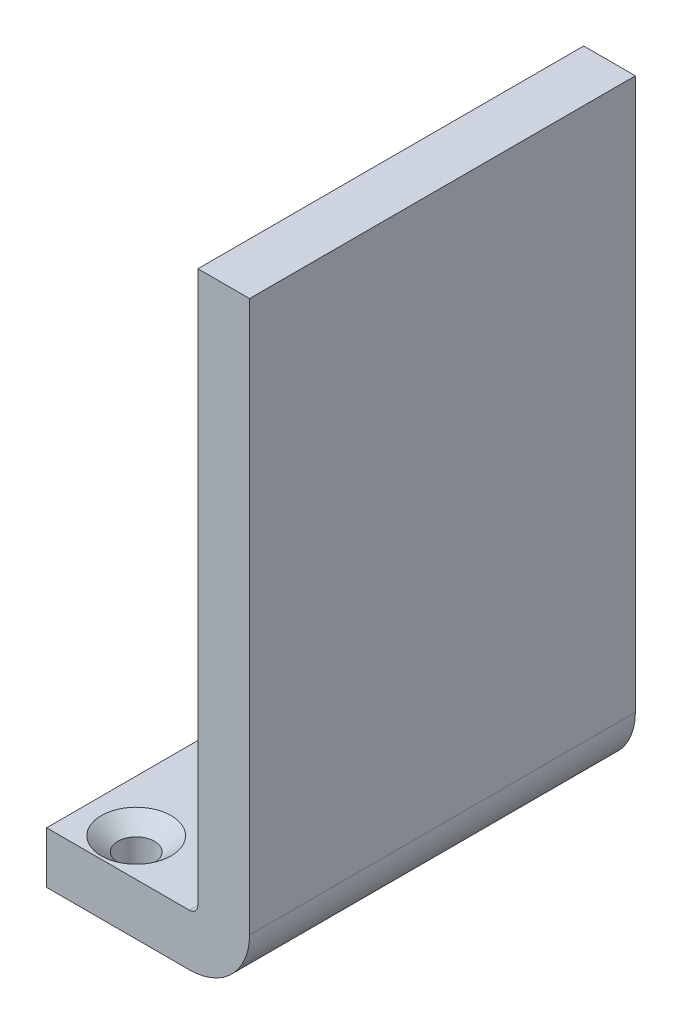
ISO-10303-21;
HEADER;
FILE_DESCRIPTION(('STEP AP214'),'2;1');
FILE_NAME('part.step','',(''),(''),'','','');
FILE_SCHEMA(('AUTOMOTIVE_DESIGN { 1 0 10303 214 1 1 1 1 }'));
ENDSEC;
DATA;
#1=APPLICATION_CONTEXT('core data for automotive mechanical design processes');
#2=APPLICATION_PROTOCOL_DEFINITION('international standard','automotive_design',2000,#1);
#3=PRODUCT_CONTEXT('',#1,'mechanical');
#4=PRODUCT('Part','Part','',(#3));
#5=PRODUCT_RELATED_PRODUCT_CATEGORY('part','',(#4));
#6=PRODUCT_DEFINITION_FORMATION('','',#4);
#7=PRODUCT_DEFINITION_CONTEXT('part definition',#1,'design');
#8=PRODUCT_DEFINITION('design','',#6,#7);
#9=PRODUCT_DEFINITION_SHAPE('','',#8);
#10=(LENGTH_UNIT() NAMED_UNIT(*) SI_UNIT(.MILLI.,.METRE.));
#11=(NAMED_UNIT(*) PLANE_ANGLE_UNIT() SI_UNIT($,.RADIAN.));
#12=(NAMED_UNIT(*) SI_UNIT($,.STERADIAN.) SOLID_ANGLE_UNIT());
#13=UNCERTAINTY_MEASURE_WITH_UNIT(LENGTH_MEASURE(1.E-05),#10,'distance_accuracy_value','');
#14=(GEOMETRIC_REPRESENTATION_CONTEXT(3) GLOBAL_UNCERTAINTY_ASSIGNED_CONTEXT((#13)) GLOBAL_UNIT_ASSIGNED_CONTEXT((#10,
#11,#12)) REPRESENTATION_CONTEXT('',''));
#15=CARTESIAN_POINT('',(0.,0.,0.));
#16=DIRECTION('',(0.,0.,1.));
#17=DIRECTION('',(1.,0.,0.));
#18=AXIS2_PLACEMENT_3D('',#15,#16,#17);
#19=CARTESIAN_POINT('',(0.,9.525,-2.54));
#20=DIRECTION('',(1.,0.,0.));
#21=DIRECTION('',(0.,0.,-1.));
#22=AXIS2_PLACEMENT_3D('',#19,#20,#21);
#23=PLANE('',#22);
#24=DIRECTION('',(0.,0.,1.));
#25=VECTOR('',#24,1.);
#26=CARTESIAN_POINT('',(0.,0.,-2.54));
#27=LINE('',#26,#25);
#28=CARTESIAN_POINT('',(0.,0.,-73.66));
#29=VERTEX_POINT('',#28);
#30=CARTESIAN_POINT('',(0.,0.,-2.54));
#31=VERTEX_POINT('',#30);
#32=EDGE_CURVE('E92',#29,#31,#27,.T.);
#33=ORIENTED_EDGE('',*,*,#32,.T.);
#34=DIRECTION('',(0.,-1.,0.));
#35=VECTOR('',#34,1.);
#36=CARTESIAN_POINT('',(0.,9.525,-2.54));
#37=LINE('',#36,#35);
#38=CARTESIAN_POINT('',(0.,9.525,-2.54));
#39=VERTEX_POINT('',#38);
#40=EDGE_CURVE('E45',#39,#31,#37,.T.);
#41=ORIENTED_EDGE('',*,*,#40,.F.);
#42=DIRECTION('',(0.,0.,1.));
#43=VECTOR('',#42,1.);
#44=CARTESIAN_POINT('',(0.,9.525,-2.54));
#45=LINE('',#44,#43);
#46=CARTESIAN_POINT('',(0.,9.525,-73.66));
#47=VERTEX_POINT('',#46);
#48=EDGE_CURVE('E86',#47,#39,#45,.T.);
#49=ORIENTED_EDGE('',*,*,#48,.F.);
#50=DIRECTION('',(0.,-1.,0.));
#51=VECTOR('',#50,1.);
#52=CARTESIAN_POINT('',(0.,9.525,-73.66));
#53=LINE('',#52,#51);
#54=EDGE_CURVE('E76',#47,#29,#53,.T.);
#55=ORIENTED_EDGE('',*,*,#54,.T.);
#56=EDGE_LOOP('',(#33,#41,#49,#55));
#57=FACE_BOUND('',#56,.T.);
#58=ADVANCED_FACE('F33',(#57),#23,.F.);
#59=CARTESIAN_POINT('',(0.,9.525,-2.54));
#60=DIRECTION('',(0.,0.,-1.));
#61=DIRECTION('',(-1.,0.,0.));
#62=AXIS2_PLACEMENT_3D('',#59,#60,#61);
#63=PLANE('',#62);
#64=DIRECTION('',(1.,0.,0.));
#65=VECTOR('',#64,1.);
#66=CARTESIAN_POINT('',(0.,0.,-2.54));
#67=LINE('',#66,#65);
#68=CARTESIAN_POINT('',(26.2934153459015,0.,-2.54));
#69=VERTEX_POINT('',#68);
#70=EDGE_CURVE('E87',#31,#69,#67,.T.);
#71=ORIENTED_EDGE('',*,*,#70,.T.);
#72=CARTESIAN_POINT('',(26.2934153459015,11.1125,-2.54));
#73=DIRECTION('',(0.,0.,1.));
#74=DIRECTION('',(1.,0.,0.));
#75=AXIS2_PLACEMENT_3D('',#72,#73,#74);
#76=CIRCLE('',#75,11.1125);
#77=CARTESIAN_POINT('',(37.4059153459015,11.1125,-2.54));
#78=VERTEX_POINT('',#77);
#79=EDGE_CURVE('E175',#69,#78,#76,.T.);
#80=ORIENTED_EDGE('',*,*,#79,.T.);
#81=DIRECTION('',(0.,1.,0.));
#82=VECTOR('',#81,1.);
#83=CARTESIAN_POINT('',(37.4059153459015,11.1125,-2.54));
#84=LINE('',#83,#82);
#85=CARTESIAN_POINT('',(37.4059153459015,112.7125,-2.54));
#86=VERTEX_POINT('',#85);
#87=EDGE_CURVE('E151',#78,#86,#84,.T.);
#88=ORIENTED_EDGE('',*,*,#87,.T.);
#89=DIRECTION('',(1.,0.,0.));
#90=VECTOR('',#89,1.);
#91=CARTESIAN_POINT('',(27.8809153459015,112.7125,-2.54));
#92=LINE('',#91,#90);
#93=CARTESIAN_POINT('',(27.8809153459015,112.7125,-2.54));
#94=VERTEX_POINT('',#93);
#95=EDGE_CURVE('E172',#94,#86,#92,.T.);
#96=ORIENTED_EDGE('',*,*,#95,.F.);
#97=DIRECTION('',(0.,1.,0.));
#98=VECTOR('',#97,1.);
#99=CARTESIAN_POINT('',(27.8809153459015,11.1125,-2.54));
#100=LINE('',#99,#98);
#101=CARTESIAN_POINT('',(27.8809153459015,11.1125,-2.54));
#102=VERTEX_POINT('',#101);
#103=EDGE_CURVE('E160',#102,#94,#100,.T.);
#104=ORIENTED_EDGE('',*,*,#103,.F.);
#105=CARTESIAN_POINT('',(26.2934153459015,11.1125,-2.54));
#106=DIRECTION('',(0.,0.,1.));
#107=DIRECTION('',(1.,0.,0.));
#108=AXIS2_PLACEMENT_3D('',#105,#106,#107);
#109=CIRCLE('',#108,1.5875);
#110=CARTESIAN_POINT('',(26.2934153459015,9.525,-2.54));
#111=VERTEX_POINT('',#110);
#112=EDGE_CURVE('E116',#111,#102,#109,.T.);
#113=ORIENTED_EDGE('',*,*,#112,.F.);
#114=DIRECTION('',(1.,0.,0.));
#115=VECTOR('',#114,1.);
#116=CARTESIAN_POINT('',(0.,9.525,-2.54));
#117=LINE('',#116,#115);
#118=EDGE_CURVE('E112',#39,#111,#117,.T.);
#119=ORIENTED_EDGE('',*,*,#118,.F.);
#120=ORIENTED_EDGE('',*,*,#40,.T.);
#121=EDGE_LOOP('',(#71,#80,#88,#96,#104,#113,#119,#120));
#122=FACE_BOUND('',#121,.T.);
#123=ADVANCED_FACE('F106',(#122),#63,.F.);
#124=CARTESIAN_POINT('',(0.,9.525,-73.66));
#125=DIRECTION('',(0.,0.,1.));
#126=DIRECTION('',(1.,0.,0.));
#127=AXIS2_PLACEMENT_3D('',#124,#125,#126);
#128=PLANE('',#127);
#129=DIRECTION('',(-1.,0.,0.));
#130=VECTOR('',#129,1.);
#131=CARTESIAN_POINT('',(0.,0.,-73.66));
#132=LINE('',#131,#130);
#133=CARTESIAN_POINT('',(26.2934153459015,0.,-73.66));
#134=VERTEX_POINT('',#133);
#135=EDGE_CURVE('E73',#134,#29,#132,.T.);
#136=ORIENTED_EDGE('',*,*,#135,.T.);
#137=ORIENTED_EDGE('',*,*,#54,.F.);
#138=DIRECTION('',(-1.,0.,0.));
#139=VECTOR('',#138,1.);
#140=CARTESIAN_POINT('',(0.,9.525,-73.66));
#141=LINE('',#140,#139);
#142=CARTESIAN_POINT('',(26.2934153459015,9.525,-73.66));
#143=VERTEX_POINT('',#142);
#144=EDGE_CURVE('E59',#143,#47,#141,.T.);
#145=ORIENTED_EDGE('',*,*,#144,.F.);
#146=CARTESIAN_POINT('',(26.2934153459015,11.1125,-73.66));
#147=DIRECTION('',(0.,0.,1.));
#148=DIRECTION('',(1.,0.,0.));
#149=AXIS2_PLACEMENT_3D('',#146,#147,#148);
#150=CIRCLE('',#149,1.5875);
#151=CARTESIAN_POINT('',(27.8809153459015,11.1125,-73.66));
#152=VERTEX_POINT('',#151);
#153=EDGE_CURVE('E178',#143,#152,#150,.T.);
#154=ORIENTED_EDGE('',*,*,#153,.T.);
#155=DIRECTION('',(0.,1.,0.));
#156=VECTOR('',#155,1.);
#157=CARTESIAN_POINT('',(27.8809153459015,11.1125,-73.66));
#158=LINE('',#157,#156);
#159=CARTESIAN_POINT('',(27.8809153459015,112.7125,-73.66));
#160=VERTEX_POINT('',#159);
#161=EDGE_CURVE('E157',#152,#160,#158,.T.);
#162=ORIENTED_EDGE('',*,*,#161,.T.);
#163=DIRECTION('',(-1.,0.,0.));
#164=VECTOR('',#163,1.);
#165=CARTESIAN_POINT('',(27.8809153459015,112.7125,-73.66));
#166=LINE('',#165,#164);
#167=CARTESIAN_POINT('',(37.4059153459015,112.7125,-73.66));
#168=VERTEX_POINT('',#167);
#169=EDGE_CURVE('E166',#168,#160,#166,.T.);
#170=ORIENTED_EDGE('',*,*,#169,.F.);
#171=DIRECTION('',(0.,1.,0.));
#172=VECTOR('',#171,1.);
#173=CARTESIAN_POINT('',(37.4059153459015,11.1125,-73.66));
#174=LINE('',#173,#172);
#175=CARTESIAN_POINT('',(37.4059153459015,11.1125,-73.66));
#176=VERTEX_POINT('',#175);
#177=EDGE_CURVE('E154',#176,#168,#174,.T.);
#178=ORIENTED_EDGE('',*,*,#177,.F.);
#179=CARTESIAN_POINT('',(26.2934153459015,11.1125,-73.66));
#180=DIRECTION('',(0.,0.,1.));
#181=DIRECTION('',(1.,0.,0.));
#182=AXIS2_PLACEMENT_3D('',#179,#180,#181);
#183=CIRCLE('',#182,11.1125);
#184=EDGE_CURVE('E81',#134,#176,#183,.T.);
#185=ORIENTED_EDGE('',*,*,#184,.F.);
#186=EDGE_LOOP('',(#136,#137,#145,#154,#162,#170,#178,#185));
#187=FACE_BOUND('',#186,.T.);
#188=ADVANCED_FACE('F75',(#187),#128,.F.);
#189=CARTESIAN_POINT('',(0.,9.525,0.));
#190=DIRECTION('',(0.,-1.,0.));
#191=DIRECTION('',(0.,0.,-1.));
#192=AXIS2_PLACEMENT_3D('',#189,#190,#191);
#193=PLANE('',#192);
#194=CARTESIAN_POINT('',(9.525,9.525,-9.525));
#195=DIRECTION('',(0.,1.,0.));
#196=DIRECTION('',(0.,0.,1.));
#197=AXIS2_PLACEMENT_3D('',#194,#195,#196);
#198=CIRCLE('',#197,6.4389);
#199=CARTESIAN_POINT('',(9.525,9.525,-3.0861));
#200=VERTEX_POINT('',#199);
#201=EDGE_CURVE('E148',#200,#200,#198,.T.);
#202=ORIENTED_EDGE('',*,*,#201,.F.);
#203=EDGE_LOOP('',(#202));
#204=FACE_BOUND('',#203,.T.);
#205=CARTESIAN_POINT('',(9.52499999999999,9.525,-45.4406));
#206=DIRECTION('',(0.,1.,0.));
#207=DIRECTION('',(0.,0.,1.));
#208=AXIS2_PLACEMENT_3D('',#205,#206,#207);
#209=CIRCLE('',#208,6.4389);
#210=CARTESIAN_POINT('',(13.2418497911538,9.525,-40.1828));
#211=VERTEX_POINT('',#210);
#212=CARTESIAN_POINT('',(5.8081502088462,9.525,-40.1828));
#213=VERTEX_POINT('',#212);
#214=EDGE_CURVE('E132',#211,#213,#209,.T.);
#215=ORIENTED_EDGE('',*,*,#214,.F.);
#216=CARTESIAN_POINT('',(9.525,9.525,-34.925));
#217=DIRECTION('',(0.,1.,0.));
#218=DIRECTION('',(0.,0.,1.));
#219=AXIS2_PLACEMENT_3D('',#216,#217,#218);
#220=CIRCLE('',#219,6.4389);
#221=EDGE_CURVE('E51',#213,#211,#220,.T.);
#222=ORIENTED_EDGE('',*,*,#221,.F.);
#223=EDGE_LOOP('',(#215,#222));
#224=FACE_BOUND('',#223,.T.);
#225=CARTESIAN_POINT('',(9.52499999999999,9.525,-66.3194));
#226=DIRECTION('',(0.,1.,0.));
#227=DIRECTION('',(0.,0.,1.));
#228=AXIS2_PLACEMENT_3D('',#225,#226,#227);
#229=CIRCLE('',#228,6.4389);
#230=CARTESIAN_POINT('',(9.52499999999999,9.525,-59.8805));
#231=VERTEX_POINT('',#230);
#232=EDGE_CURVE('E123',#231,#231,#229,.T.);
#233=ORIENTED_EDGE('',*,*,#232,.F.);
#234=EDGE_LOOP('',(#233));
#235=FACE_BOUND('',#234,.T.);
#236=ORIENTED_EDGE('',*,*,#48,.T.);
#237=ORIENTED_EDGE('',*,*,#118,.T.);
#238=DIRECTION('',(0.,0.,1.));
#239=VECTOR('',#238,1.);
#240=CARTESIAN_POINT('',(26.2934153459015,9.525,-2.54));
#241=LINE('',#240,#239);
#242=EDGE_CURVE('E188',#143,#111,#241,.T.);
#243=ORIENTED_EDGE('',*,*,#242,.F.);
#244=ORIENTED_EDGE('',*,*,#144,.T.);
#245=EDGE_LOOP('',(#236,#237,#243,#244));
#246=FACE_BOUND('',#245,.T.);
#247=ADVANCED_FACE('F118',(#204,#224,#235,#246),#193,.F.);
#248=CARTESIAN_POINT('',(0.,0.,0.));
#249=DIRECTION('',(0.,-1.,0.));
#250=DIRECTION('',(0.,0.,-1.));
#251=AXIS2_PLACEMENT_3D('',#248,#249,#250);
#252=PLANE('',#251);
#253=CARTESIAN_POINT('',(9.525,0.,-9.525));
#254=DIRECTION('',(0.,1.,0.));
#255=DIRECTION('',(0.,0.,1.));
#256=AXIS2_PLACEMENT_3D('',#253,#254,#255);
#257=CIRCLE('',#256,3.3782);
#258=CARTESIAN_POINT('',(9.525,0.,-6.1468));
#259=VERTEX_POINT('',#258);
#260=EDGE_CURVE('E142',#259,#259,#257,.T.);
#261=ORIENTED_EDGE('',*,*,#260,.T.);
#262=EDGE_LOOP('',(#261));
#263=FACE_BOUND('',#262,.T.);
#264=CARTESIAN_POINT('',(9.525,0.,-34.925));
#265=DIRECTION('',(0.,1.,0.));
#266=DIRECTION('',(0.,0.,1.));
#267=AXIS2_PLACEMENT_3D('',#264,#265,#266);
#268=CIRCLE('',#267,3.3782);
#269=CARTESIAN_POINT('',(9.525,0.,-31.5468));
#270=VERTEX_POINT('',#269);
#271=EDGE_CURVE('E135',#270,#270,#268,.T.);
#272=ORIENTED_EDGE('',*,*,#271,.T.);
#273=EDGE_LOOP('',(#272));
#274=FACE_BOUND('',#273,.T.);
#275=CARTESIAN_POINT('',(9.52499999999999,0.,-45.4406));
#276=DIRECTION('',(0.,1.,0.));
#277=DIRECTION('',(0.,0.,1.));
#278=AXIS2_PLACEMENT_3D('',#275,#276,#277);
#279=CIRCLE('',#278,3.3782);
#280=CARTESIAN_POINT('',(9.52499999999999,0.,-42.0624));
#281=VERTEX_POINT('',#280);
#282=EDGE_CURVE('E126',#281,#281,#279,.T.);
#283=ORIENTED_EDGE('',*,*,#282,.T.);
#284=EDGE_LOOP('',(#283));
#285=FACE_BOUND('',#284,.T.);
#286=CARTESIAN_POINT('',(9.52499999999999,0.,-66.3194));
#287=DIRECTION('',(0.,1.,0.));
#288=DIRECTION('',(0.,0.,1.));
#289=AXIS2_PLACEMENT_3D('',#286,#287,#288);
#290=CIRCLE('',#289,3.3782);
#291=CARTESIAN_POINT('',(9.52499999999999,0.,-62.9412));
#292=VERTEX_POINT('',#291);
#293=EDGE_CURVE('E97',#292,#292,#290,.T.);
#294=ORIENTED_EDGE('',*,*,#293,.T.);
#295=EDGE_LOOP('',(#294));
#296=FACE_BOUND('',#295,.T.);
#297=ORIENTED_EDGE('',*,*,#32,.F.);
#298=ORIENTED_EDGE('',*,*,#135,.F.);
#299=DIRECTION('',(0.,0.,-1.));
#300=VECTOR('',#299,1.);
#301=CARTESIAN_POINT('',(26.2934153459015,0.,-2.54));
#302=LINE('',#301,#300);
#303=EDGE_CURVE('E190',#69,#134,#302,.T.);
#304=ORIENTED_EDGE('',*,*,#303,.F.);
#305=ORIENTED_EDGE('',*,*,#70,.F.);
#306=EDGE_LOOP('',(#297,#298,#304,#305));
#307=FACE_BOUND('',#306,.T.);
#308=ADVANCED_FACE('F94',(#263,#274,#285,#296,#307),#252,.T.);
#309=CARTESIAN_POINT('',(9.52499999999999,9.525,-66.3194));
#310=DIRECTION('',(0.,1.,0.));
#311=DIRECTION('',(0.,0.,1.));
#312=AXIS2_PLACEMENT_3D('',#309,#310,#311);
#313=CYLINDRICAL_SURFACE('',#312,3.3782);
#314=ORIENTED_EDGE('',*,*,#293,.F.);
#315=EDGE_LOOP('',(#314));
#316=FACE_BOUND('',#315,.T.);
#317=CARTESIAN_POINT('',(9.52499999999999,6.9567677588557,-66.3194));
#318=DIRECTION('',(0.,1.,0.));
#319=DIRECTION('',(0.,0.,1.));
#320=AXIS2_PLACEMENT_3D('',#317,#318,#319);
#321=CIRCLE('',#320,3.3782);
#322=CARTESIAN_POINT('',(9.52499999999999,6.9567677588557,-62.9412));
#323=VERTEX_POINT('',#322);
#324=EDGE_CURVE('E101',#323,#323,#321,.T.);
#325=ORIENTED_EDGE('',*,*,#324,.T.);
#326=EDGE_LOOP('',(#325));
#327=FACE_BOUND('',#326,.T.);
#328=ADVANCED_FACE('F253',(#316,#327),#313,.F.);
#329=CARTESIAN_POINT('',(9.52499999999999,9.525,-66.3194));
#330=DIRECTION('',(0.,1.,0.));
#331=DIRECTION('',(0.,0.,1.));
#332=AXIS2_PLACEMENT_3D('',#329,#330,#331);
#333=CONICAL_SURFACE('',#332,6.4389,0.872664625997166);
#334=ORIENTED_EDGE('',*,*,#324,.F.);
#335=EDGE_LOOP('',(#334));
#336=FACE_BOUND('',#335,.T.);
#337=ORIENTED_EDGE('',*,*,#232,.T.);
#338=EDGE_LOOP('',(#337));
#339=FACE_BOUND('',#338,.T.);
#340=ADVANCED_FACE('F236',(#336,#339),#333,.F.);
#341=CARTESIAN_POINT('',(9.52499999999999,9.525,-45.4406));
#342=DIRECTION('',(0.,1.,0.));
#343=DIRECTION('',(0.,0.,1.));
#344=AXIS2_PLACEMENT_3D('',#341,#342,#343);
#345=CYLINDRICAL_SURFACE('',#344,3.3782);
#346=ORIENTED_EDGE('',*,*,#282,.F.);
#347=EDGE_LOOP('',(#346));
#348=FACE_BOUND('',#347,.T.);
#349=CARTESIAN_POINT('',(9.52499999999999,6.9567677588557,-45.4406));
#350=DIRECTION('',(0.,1.,0.));
#351=DIRECTION('',(0.,0.,1.));
#352=AXIS2_PLACEMENT_3D('',#349,#350,#351);
#353=CIRCLE('',#352,3.3782);
#354=CARTESIAN_POINT('',(9.52499999999999,6.9567677588557,-42.0624));
#355=VERTEX_POINT('',#354);
#356=EDGE_CURVE('E129',#355,#355,#353,.T.);
#357=ORIENTED_EDGE('',*,*,#356,.T.);
#358=EDGE_LOOP('',(#357));
#359=FACE_BOUND('',#358,.T.);
#360=ADVANCED_FACE('F228',(#348,#359),#345,.F.);
#361=CARTESIAN_POINT('',(9.52499999999999,9.525,-45.4406));
#362=DIRECTION('',(0.,1.,0.));
#363=DIRECTION('',(0.,0.,1.));
#364=AXIS2_PLACEMENT_3D('',#361,#362,#363);
#365=CONICAL_SURFACE('',#364,6.4389,0.872664625997165);
#366=ORIENTED_EDGE('',*,*,#356,.F.);
#367=EDGE_LOOP('',(#366));
#368=FACE_BOUND('',#367,.T.);
#369=ORIENTED_EDGE('',*,*,#214,.T.);
#370=CARTESIAN_POINT('',(5.80773731629119,9.5252,-40.1828));
#371=CARTESIAN_POINT('',(5.91825555733399,9.47167170772379,-40.1828));
#372=CARTESIAN_POINT('',(6.02939145108273,9.4194208187292,-40.1828));
#373=CARTESIAN_POINT('',(6.25303839628447,9.31785758896267,-40.1828));
#374=CARTESIAN_POINT('',(6.36554987165421,9.2685461830473,-40.1828));
#375=CARTESIAN_POINT('',(6.70621742130214,9.12524089860833,-40.1828));
#376=CARTESIAN_POINT('',(6.93656601273653,9.03633936822955,-40.1828));
#377=CARTESIAN_POINT('',(7.4016049988188,8.87683546674913,-40.1828));
#378=CARTESIAN_POINT('',(7.63624778575361,8.80609635299186,-40.1828));
#379=CARTESIAN_POINT('',(8.11076892938057,8.68681891595934,-40.1828));
#380=CARTESIAN_POINT('',(8.35063562985329,8.63823560040428,-40.1828));
#381=CARTESIAN_POINT('',(8.782500347839,8.57494345177309,-40.1828));
#382=CARTESIAN_POINT('',(8.97375979398913,8.55521098985455,-40.1828));
#383=CARTESIAN_POINT('',(9.35733528421093,8.53326400105839,-40.1828));
#384=CARTESIAN_POINT('',(9.54965145755658,8.53105166749087,-40.1828));
#385=CARTESIAN_POINT('',(9.93374990151626,8.54431828455256,-40.1828));
#386=CARTESIAN_POINT('',(10.1255318741165,8.55980566418323,-40.1828));
#387=CARTESIAN_POINT('',(10.5069727075907,8.60743079407081,-40.1828));
#388=CARTESIAN_POINT('',(10.696631583647,8.63956842518453,-40.1828));
#389=CARTESIAN_POINT('',(11.0894052016253,8.72208078427035,-40.1828));
#390=CARTESIAN_POINT('',(11.2922306037224,8.77381448596506,-40.1828));
#391=CARTESIAN_POINT('',(11.6936652821695,8.89188137928578,-40.1828));
#392=CARTESIAN_POINT('',(11.892271459638,8.9582249207509,-40.1828));
#393=CARTESIAN_POINT('',(12.285341135383,9.10277544415048,-40.1828));
#394=CARTESIAN_POINT('',(12.4797994549578,9.18099636759885,-40.1828));
#395=CARTESIAN_POINT('',(12.7682005162649,9.30528783674452,-40.1828));
#396=CARTESIAN_POINT('',(12.8636896400967,9.3478308736082,-40.1828));
#397=CARTESIAN_POINT('',(13.0536895133975,9.43500686680251,-40.1828));
#398=CARTESIAN_POINT('',(13.1482004339717,9.47963944982396,-40.1828));
#399=CARTESIAN_POINT('',(13.2422626837094,9.52520000000029,-40.1828));
#400=B_SPLINE_CURVE_WITH_KNOTS('',3,(#370,#371,#372,#373,#374,#375,#376,#377,#378,#379,#380,
#381,#382,#383,#384,#385,#386,#387,#388,#389,#390,#391,#392,#393,#394,#395,#396,#397,#398,#399),
.UNSPECIFIED.,.F.,.F.,(4,2,2,2,2,2,2,2,2,2,2,2,2,2,4),(0.,0.368380629097658,0.736877797604351,
1.47701350375182,2.21140161772303,2.9442916786391,3.52037625516766,4.09653294944133,
4.67296413686332,5.2493911996088,5.87668060170418,6.50441582321474,7.13289365071325,
7.44648616757064,7.76002287157786),.UNSPECIFIED.);
#401=EDGE_CURVE('E11',#213,#211,#400,.T.);
#402=ORIENTED_EDGE('',*,*,#401,.T.);
#403=EDGE_LOOP('',(#369,#402));
#404=FACE_BOUND('',#403,.T.);
#405=ADVANCED_FACE('F226',(#368,#404),#365,.F.);
#406=CARTESIAN_POINT('',(9.525,9.525,-34.925));
#407=DIRECTION('',(0.,1.,0.));
#408=DIRECTION('',(0.,0.,1.));
#409=AXIS2_PLACEMENT_3D('',#406,#407,#408);
#410=CONICAL_SURFACE('',#409,6.4389,0.872664625997165);
#411=CARTESIAN_POINT('',(9.525,6.9567677588557,-34.925));
#412=DIRECTION('',(0.,1.,0.));
#413=DIRECTION('',(0.,0.,1.));
#414=AXIS2_PLACEMENT_3D('',#411,#412,#413);
#415=CIRCLE('',#414,3.3782);
#416=CARTESIAN_POINT('',(9.525,6.9567677588557,-31.5468));
#417=VERTEX_POINT('',#416);
#418=EDGE_CURVE('E138',#417,#417,#415,.T.);
#419=ORIENTED_EDGE('',*,*,#418,.F.);
#420=EDGE_LOOP('',(#419));
#421=FACE_BOUND('',#420,.T.);
#422=ORIENTED_EDGE('',*,*,#221,.T.);
#423=ORIENTED_EDGE('',*,*,#401,.F.);
#424=EDGE_LOOP('',(#422,#423));
#425=FACE_BOUND('',#424,.T.);
#426=ADVANCED_FACE('F221',(#421,#425),#410,.F.);
#427=CARTESIAN_POINT('',(9.525,9.525,-34.925));
#428=DIRECTION('',(0.,1.,0.));
#429=DIRECTION('',(0.,0.,1.));
#430=AXIS2_PLACEMENT_3D('',#427,#428,#429);
#431=CYLINDRICAL_SURFACE('',#430,3.3782);
#432=ORIENTED_EDGE('',*,*,#271,.F.);
#433=EDGE_LOOP('',(#432));
#434=FACE_BOUND('',#433,.T.);
#435=ORIENTED_EDGE('',*,*,#418,.T.);
#436=EDGE_LOOP('',(#435));
#437=FACE_BOUND('',#436,.T.);
#438=ADVANCED_FACE('F234',(#434,#437),#431,.F.);
#439=CARTESIAN_POINT('',(9.525,9.525,-9.525));
#440=DIRECTION('',(0.,1.,0.));
#441=DIRECTION('',(0.,0.,1.));
#442=AXIS2_PLACEMENT_3D('',#439,#440,#441);
#443=CYLINDRICAL_SURFACE('',#442,3.3782);
#444=ORIENTED_EDGE('',*,*,#260,.F.);
#445=EDGE_LOOP('',(#444));
#446=FACE_BOUND('',#445,.T.);
#447=CARTESIAN_POINT('',(9.525,6.9567677588557,-9.525));
#448=DIRECTION('',(0.,1.,0.));
#449=DIRECTION('',(0.,0.,1.));
#450=AXIS2_PLACEMENT_3D('',#447,#448,#449);
#451=CIRCLE('',#450,3.3782);
#452=CARTESIAN_POINT('',(9.525,6.9567677588557,-6.1468));
#453=VERTEX_POINT('',#452);
#454=EDGE_CURVE('E145',#453,#453,#451,.T.);
#455=ORIENTED_EDGE('',*,*,#454,.T.);
#456=EDGE_LOOP('',(#455));
#457=FACE_BOUND('',#456,.T.);
#458=ADVANCED_FACE('F294',(#446,#457),#443,.F.);
#459=CARTESIAN_POINT('',(9.525,9.525,-9.525));
#460=DIRECTION('',(0.,1.,0.));
#461=DIRECTION('',(0.,0.,1.));
#462=AXIS2_PLACEMENT_3D('',#459,#460,#461);
#463=CONICAL_SURFACE('',#462,6.4389,0.872664625997165);
#464=ORIENTED_EDGE('',*,*,#454,.F.);
#465=EDGE_LOOP('',(#464));
#466=FACE_BOUND('',#465,.T.);
#467=ORIENTED_EDGE('',*,*,#201,.T.);
#468=EDGE_LOOP('',(#467));
#469=FACE_BOUND('',#468,.T.);
#470=ADVANCED_FACE('F303',(#466,#469),#463,.F.);
#471=CARTESIAN_POINT('',(37.4059153459015,11.1125,-2.54));
#472=DIRECTION('',(1.,0.,0.));
#473=DIRECTION('',(0.,1.,0.));
#474=AXIS2_PLACEMENT_3D('',#471,#472,#473);
#475=PLANE('',#474);
#476=DIRECTION('',(0.,0.,-1.));
#477=VECTOR('',#476,1.);
#478=CARTESIAN_POINT('',(37.4059153459015,11.1125,-2.54));
#479=LINE('',#478,#477);
#480=EDGE_CURVE('E182',#78,#176,#479,.T.);
#481=ORIENTED_EDGE('',*,*,#480,.T.);
#482=ORIENTED_EDGE('',*,*,#177,.T.);
#483=DIRECTION('',(0.,0.,-1.));
#484=VECTOR('',#483,1.);
#485=CARTESIAN_POINT('',(37.4059153459015,112.7125,-2.54));
#486=LINE('',#485,#484);
#487=EDGE_CURVE('E163',#86,#168,#486,.T.);
#488=ORIENTED_EDGE('',*,*,#487,.F.);
#489=ORIENTED_EDGE('',*,*,#87,.F.);
#490=EDGE_LOOP('',(#481,#482,#488,#489));
#491=FACE_BOUND('',#490,.T.);
#492=ADVANCED_FACE('F312',(#491),#475,.T.);
#493=CARTESIAN_POINT('',(27.8809153459015,11.1125,-2.54));
#494=DIRECTION('',(-1.,0.,0.));
#495=DIRECTION('',(0.,-1.,0.));
#496=AXIS2_PLACEMENT_3D('',#493,#494,#495);
#497=PLANE('',#496);
#498=DIRECTION('',(0.,0.,1.));
#499=VECTOR('',#498,1.);
#500=CARTESIAN_POINT('',(27.8809153459015,11.1125,-2.54));
#501=LINE('',#500,#499);
#502=EDGE_CURVE('E185',#152,#102,#501,.T.);
#503=ORIENTED_EDGE('',*,*,#502,.T.);
#504=ORIENTED_EDGE('',*,*,#103,.T.);
#505=DIRECTION('',(0.,0.,1.));
#506=VECTOR('',#505,1.);
#507=CARTESIAN_POINT('',(27.8809153459015,112.7125,-2.54));
#508=LINE('',#507,#506);
#509=EDGE_CURVE('E169',#160,#94,#508,.T.);
#510=ORIENTED_EDGE('',*,*,#509,.F.);
#511=ORIENTED_EDGE('',*,*,#161,.F.);
#512=EDGE_LOOP('',(#503,#504,#510,#511));
#513=FACE_BOUND('',#512,.T.);
#514=ADVANCED_FACE('F351',(#513),#497,.T.);
#515=CARTESIAN_POINT('',(26.2934153459015,11.1125,-73.66));
#516=DIRECTION('',(0.,0.,1.));
#517=DIRECTION('',(1.,0.,0.));
#518=AXIS2_PLACEMENT_3D('',#515,#516,#517);
#519=CYLINDRICAL_SURFACE('',#518,11.1125);
#520=ORIENTED_EDGE('',*,*,#303,.T.);
#521=ORIENTED_EDGE('',*,*,#184,.T.);
#522=ORIENTED_EDGE('',*,*,#480,.F.);
#523=ORIENTED_EDGE('',*,*,#79,.F.);
#524=EDGE_LOOP('',(#520,#521,#522,#523));
#525=FACE_BOUND('',#524,.T.);
#526=ADVANCED_FACE('F192',(#525),#519,.T.);
#527=CARTESIAN_POINT('',(26.2934153459015,11.1125,-73.66));
#528=DIRECTION('',(0.,0.,1.));
#529=DIRECTION('',(1.,0.,0.));
#530=AXIS2_PLACEMENT_3D('',#527,#528,#529);
#531=CYLINDRICAL_SURFACE('',#530,1.5875);
#532=ORIENTED_EDGE('',*,*,#242,.T.);
#533=ORIENTED_EDGE('',*,*,#112,.T.);
#534=ORIENTED_EDGE('',*,*,#502,.F.);
#535=ORIENTED_EDGE('',*,*,#153,.F.);
#536=EDGE_LOOP('',(#532,#533,#534,#535));
#537=FACE_BOUND('',#536,.T.);
#538=ADVANCED_FACE('F370',(#537),#531,.F.);
#539=CARTESIAN_POINT('',(37.4059153459015,112.7125,0.));
#540=DIRECTION('',(0.,1.,0.));
#541=DIRECTION('',(0.,0.,-1.));
#542=AXIS2_PLACEMENT_3D('',#539,#540,#541);
#543=PLANE('',#542);
#544=ORIENTED_EDGE('',*,*,#95,.T.);
#545=ORIENTED_EDGE('',*,*,#487,.T.);
#546=ORIENTED_EDGE('',*,*,#169,.T.);
#547=ORIENTED_EDGE('',*,*,#509,.T.);
#548=EDGE_LOOP('',(#544,#545,#546,#547));
#549=FACE_BOUND('',#548,.T.);
#550=ADVANCED_FACE('F379',(#549),#543,.T.);
#551=CLOSED_SHELL('',(#58,#123,#188,#247,#308,#328,#340,#360,#405,#426,#438,#458,#470,#492,#514,
#526,#538,#550));
#552=MANIFOLD_SOLID_BREP('B2',#551);
#553=ADVANCED_BREP_SHAPE_REPRESENTATION('',(#18,#552),#14);
#554=SHAPE_DEFINITION_REPRESENTATION(#9,#553);
ENDSEC;
END-ISO-10303-21;
